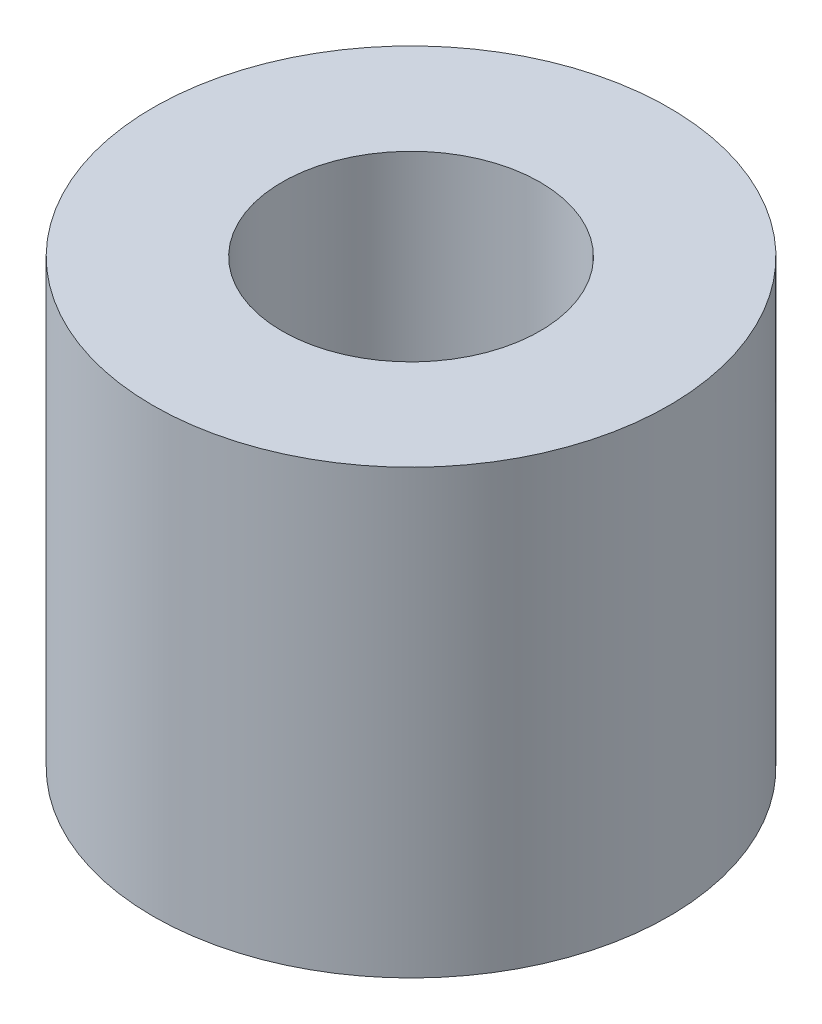
ISO-10303-21;
HEADER;
FILE_DESCRIPTION(('STEP AP214'),'2;1');
FILE_NAME('part.step','',(''),(''),'','','');
FILE_SCHEMA(('AUTOMOTIVE_DESIGN { 1 0 10303 214 1 1 1 1 }'));
ENDSEC;
DATA;
#1=APPLICATION_CONTEXT('core data for automotive mechanical design processes');
#2=APPLICATION_PROTOCOL_DEFINITION('international standard','automotive_design',2000,#1);
#3=PRODUCT_CONTEXT('',#1,'mechanical');
#4=PRODUCT('Part','Part','',(#3));
#5=PRODUCT_RELATED_PRODUCT_CATEGORY('part','',(#4));
#6=PRODUCT_DEFINITION_FORMATION('','',#4);
#7=PRODUCT_DEFINITION_CONTEXT('part definition',#1,'design');
#8=PRODUCT_DEFINITION('design','',#6,#7);
#9=PRODUCT_DEFINITION_SHAPE('','',#8);
#10=(LENGTH_UNIT() NAMED_UNIT(*) SI_UNIT(.MILLI.,.METRE.));
#11=(NAMED_UNIT(*) PLANE_ANGLE_UNIT() SI_UNIT($,.RADIAN.));
#12=(NAMED_UNIT(*) SI_UNIT($,.STERADIAN.) SOLID_ANGLE_UNIT());
#13=UNCERTAINTY_MEASURE_WITH_UNIT(LENGTH_MEASURE(1.E-05),#10,'distance_accuracy_value','');
#14=(GEOMETRIC_REPRESENTATION_CONTEXT(3) GLOBAL_UNCERTAINTY_ASSIGNED_CONTEXT((#13)) GLOBAL_UNIT_ASSIGNED_CONTEXT((#10,
#11,#12)) REPRESENTATION_CONTEXT('',''));
#15=CARTESIAN_POINT('',(0.,0.,0.));
#16=DIRECTION('',(0.,0.,1.));
#17=DIRECTION('',(1.,0.,0.));
#18=AXIS2_PLACEMENT_3D('',#15,#16,#17);
#19=CARTESIAN_POINT('',(0.,6.,0.));
#20=DIRECTION('',(0.,1.,0.));
#21=DIRECTION('',(0.,0.,1.));
#22=AXIS2_PLACEMENT_3D('',#19,#20,#21);
#23=PLANE('',#22);
#24=CARTESIAN_POINT('',(0.,6.,0.));
#25=DIRECTION('',(0.,1.,0.));
#26=DIRECTION('',(0.,0.,1.));
#27=AXIS2_PLACEMENT_3D('',#24,#25,#26);
#28=CIRCLE('',#27,3.5);
#29=CARTESIAN_POINT('',(0.,6.,3.5));
#30=VERTEX_POINT('',#29);
#31=EDGE_CURVE('E10',#30,#30,#28,.T.);
#32=ORIENTED_EDGE('',*,*,#31,.T.);
#33=EDGE_LOOP('',(#32));
#34=FACE_BOUND('',#33,.T.);
#35=CARTESIAN_POINT('',(0.,6.,0.));
#36=DIRECTION('',(0.,1.,0.));
#37=DIRECTION('',(0.,0.,1.));
#38=AXIS2_PLACEMENT_3D('',#35,#36,#37);
#39=CIRCLE('',#38,1.75);
#40=CARTESIAN_POINT('',(0.,6.,1.75));
#41=VERTEX_POINT('',#40);
#42=EDGE_CURVE('E42',#41,#41,#39,.T.);
#43=ORIENTED_EDGE('',*,*,#42,.F.);
#44=EDGE_LOOP('',(#43));
#45=FACE_BOUND('',#44,.T.);
#46=ADVANCED_FACE('F31',(#34,#45),#23,.T.);
#47=CARTESIAN_POINT('',(0.,0.,0.));
#48=DIRECTION('',(0.,1.,0.));
#49=DIRECTION('',(0.,0.,1.));
#50=AXIS2_PLACEMENT_3D('',#47,#48,#49);
#51=PLANE('',#50);
#52=CARTESIAN_POINT('',(0.,0.,0.));
#53=DIRECTION('',(0.,1.,0.));
#54=DIRECTION('',(0.,0.,1.));
#55=AXIS2_PLACEMENT_3D('',#52,#53,#54);
#56=CIRCLE('',#55,3.5);
#57=CARTESIAN_POINT('',(0.,0.,3.5));
#58=VERTEX_POINT('',#57);
#59=EDGE_CURVE('E35',#58,#58,#56,.T.);
#60=ORIENTED_EDGE('',*,*,#59,.F.);
#61=EDGE_LOOP('',(#60));
#62=FACE_BOUND('',#61,.T.);
#63=CARTESIAN_POINT('',(0.,0.,0.));
#64=DIRECTION('',(0.,1.,0.));
#65=DIRECTION('',(0.,0.,1.));
#66=AXIS2_PLACEMENT_3D('',#63,#64,#65);
#67=CIRCLE('',#66,1.75);
#68=CARTESIAN_POINT('',(0.,0.,1.75));
#69=VERTEX_POINT('',#68);
#70=EDGE_CURVE('E44',#69,#69,#67,.T.);
#71=ORIENTED_EDGE('',*,*,#70,.T.);
#72=EDGE_LOOP('',(#71));
#73=FACE_BOUND('',#72,.T.);
#74=ADVANCED_FACE('F54',(#62,#73),#51,.F.);
#75=CARTESIAN_POINT('',(0.,6.,0.));
#76=DIRECTION('',(0.,-1.,0.));
#77=DIRECTION('',(0.,0.,-1.));
#78=AXIS2_PLACEMENT_3D('',#75,#76,#77);
#79=CYLINDRICAL_SURFACE('',#78,3.5);
#80=ORIENTED_EDGE('',*,*,#31,.F.);
#81=EDGE_LOOP('',(#80));
#82=FACE_BOUND('',#81,.T.);
#83=ORIENTED_EDGE('',*,*,#59,.T.);
#84=EDGE_LOOP('',(#83));
#85=FACE_BOUND('',#84,.T.);
#86=ADVANCED_FACE('F33',(#82,#85),#79,.T.);
#87=CARTESIAN_POINT('',(0.,6.,0.));
#88=DIRECTION('',(0.,-1.,0.));
#89=DIRECTION('',(0.,0.,-1.));
#90=AXIS2_PLACEMENT_3D('',#87,#88,#89);
#91=CYLINDRICAL_SURFACE('',#90,1.75);
#92=ORIENTED_EDGE('',*,*,#42,.T.);
#93=EDGE_LOOP('',(#92));
#94=FACE_BOUND('',#93,.T.);
#95=ORIENTED_EDGE('',*,*,#70,.F.);
#96=EDGE_LOOP('',(#95));
#97=FACE_BOUND('',#96,.T.);
#98=ADVANCED_FACE('F50',(#94,#97),#91,.F.);
#99=CLOSED_SHELL('',(#46,#74,#86,#98));
#100=MANIFOLD_SOLID_BREP('B2',#99);
#101=ADVANCED_BREP_SHAPE_REPRESENTATION('',(#18,#100),#14);
#102=SHAPE_DEFINITION_REPRESENTATION(#9,#101);
ENDSEC;
END-ISO-10303-21;
